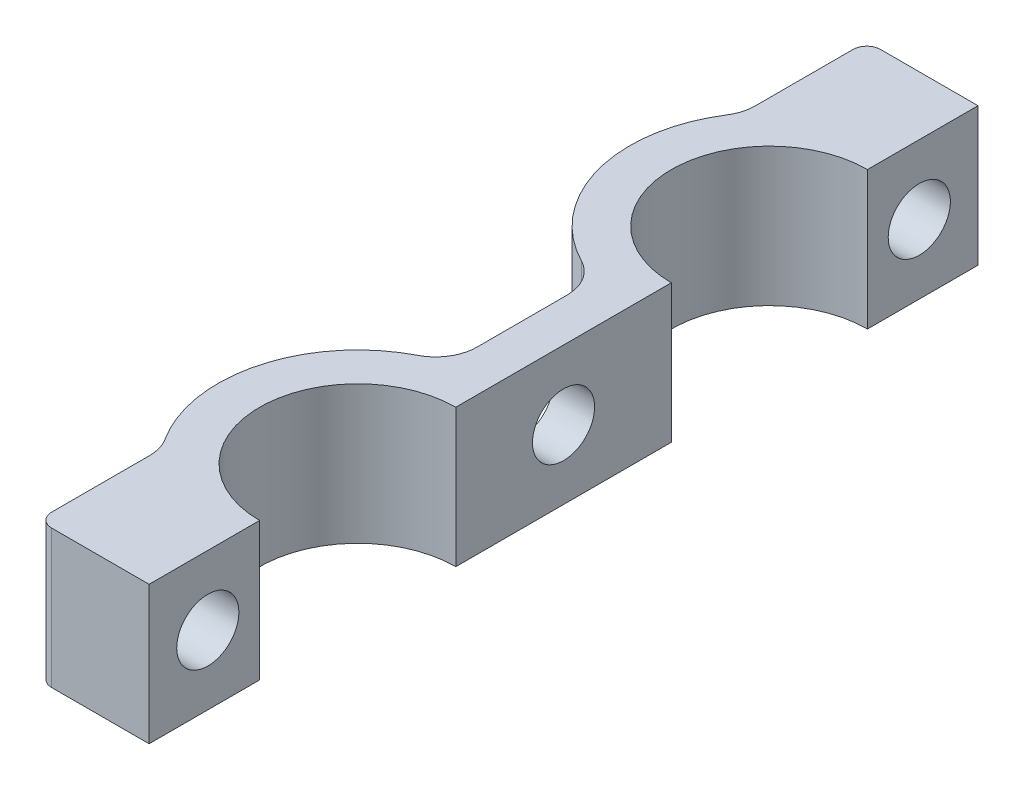
ISO-10303-21;
HEADER;
FILE_DESCRIPTION(('STEP AP214'),'2;1');
FILE_NAME('part.step','',(''),(''),'','','');
FILE_SCHEMA(('AUTOMOTIVE_DESIGN { 1 0 10303 214 1 1 1 1 }'));
ENDSEC;
DATA;
#1=APPLICATION_CONTEXT('core data for automotive mechanical design processes');
#2=APPLICATION_PROTOCOL_DEFINITION('international standard','automotive_design',2000,#1);
#3=PRODUCT_CONTEXT('',#1,'mechanical');
#4=PRODUCT('Part','Part','',(#3));
#5=PRODUCT_RELATED_PRODUCT_CATEGORY('part','',(#4));
#6=PRODUCT_DEFINITION_FORMATION('','',#4);
#7=PRODUCT_DEFINITION_CONTEXT('part definition',#1,'design');
#8=PRODUCT_DEFINITION('design','',#6,#7);
#9=PRODUCT_DEFINITION_SHAPE('','',#8);
#10=(LENGTH_UNIT() NAMED_UNIT(*) SI_UNIT(.MILLI.,.METRE.));
#11=(NAMED_UNIT(*) PLANE_ANGLE_UNIT() SI_UNIT($,.RADIAN.));
#12=(NAMED_UNIT(*) SI_UNIT($,.STERADIAN.) SOLID_ANGLE_UNIT());
#13=UNCERTAINTY_MEASURE_WITH_UNIT(LENGTH_MEASURE(1.E-05),#10,'distance_accuracy_value','');
#14=(GEOMETRIC_REPRESENTATION_CONTEXT(3) GLOBAL_UNCERTAINTY_ASSIGNED_CONTEXT((#13)) GLOBAL_UNIT_ASSIGNED_CONTEXT((#10,
#11,#12)) REPRESENTATION_CONTEXT('',''));
#15=CARTESIAN_POINT('',(0.,0.,0.));
#16=DIRECTION('',(0.,0.,1.));
#17=DIRECTION('',(1.,0.,0.));
#18=AXIS2_PLACEMENT_3D('',#15,#16,#17);
#19=CARTESIAN_POINT('',(-3.,10.,0.));
#20=DIRECTION('',(0.,0.,-1.));
#21=DIRECTION('',(-1.,0.,0.));
#22=AXIS2_PLACEMENT_3D('',#19,#20,#21);
#23=PLANE('',#22);
#24=DIRECTION('',(1.,0.,0.));
#25=VECTOR('',#24,1.);
#26=CARTESIAN_POINT('',(-3.,10.,0.));
#27=LINE('',#26,#25);
#28=CARTESIAN_POINT('',(-7.0498447189993,10.,0.));
#29=VERTEX_POINT('',#28);
#30=CARTESIAN_POINT('',(0.,10.,0.));
#31=VERTEX_POINT('',#30);
#32=EDGE_CURVE('E159',#29,#31,#27,.T.);
#33=ORIENTED_EDGE('',*,*,#32,.F.);
#34=DIRECTION('',(0.,1.,0.));
#35=VECTOR('',#34,1.);
#36=CARTESIAN_POINT('',(-7.0498447189993,0.,0.));
#37=LINE('',#36,#35);
#38=CARTESIAN_POINT('',(-7.0498447189993,0.,0.));
#39=VERTEX_POINT('',#38);
#40=EDGE_CURVE('E231',#29,#39,#37,.F.);
#41=ORIENTED_EDGE('',*,*,#40,.T.);
#42=DIRECTION('',(1.,0.,0.));
#43=VECTOR('',#42,1.);
#44=CARTESIAN_POINT('',(-3.,0.,0.));
#45=LINE('',#44,#43);
#46=CARTESIAN_POINT('',(0.,0.,0.));
#47=VERTEX_POINT('',#46);
#48=EDGE_CURVE('E181',#39,#47,#45,.T.);
#49=ORIENTED_EDGE('',*,*,#48,.T.);
#50=DIRECTION('',(0.,-1.,0.));
#51=VECTOR('',#50,1.);
#52=CARTESIAN_POINT('',(0.,10.,0.));
#53=LINE('',#52,#51);
#54=EDGE_CURVE('E174',#31,#47,#53,.T.);
#55=ORIENTED_EDGE('',*,*,#54,.F.);
#56=EDGE_LOOP('',(#33,#41,#49,#55));
#57=FACE_BOUND('',#56,.T.);
#58=ADVANCED_FACE('F35',(#57),#23,.F.);
#59=CARTESIAN_POINT('',(0.,10.,0.));
#60=DIRECTION('',(-1.,0.,0.));
#61=DIRECTION('',(0.,0.,1.));
#62=AXIS2_PLACEMENT_3D('',#59,#60,#61);
#63=PLANE('',#62);
#64=CARTESIAN_POINT('',(0.,5.,-4.25000000000001));
#65=DIRECTION('',(-1.,0.,0.));
#66=DIRECTION('',(0.,0.,-1.));
#67=AXIS2_PLACEMENT_3D('',#64,#65,#66);
#68=CIRCLE('',#67,2.25);
#69=CARTESIAN_POINT('',(0.,5.,-6.50000000000001));
#70=VERTEX_POINT('',#69);
#71=EDGE_CURVE('E393',#70,#70,#68,.T.);
#72=ORIENTED_EDGE('',*,*,#71,.T.);
#73=EDGE_LOOP('',(#72));
#74=FACE_BOUND('',#73,.T.);
#75=DIRECTION('',(0.,0.,-1.));
#76=VECTOR('',#75,1.);
#77=CARTESIAN_POINT('',(0.,0.,0.));
#78=LINE('',#77,#76);
#79=CARTESIAN_POINT('',(0.,0.,-8.));
#80=VERTEX_POINT('',#79);
#81=EDGE_CURVE('E264',#47,#80,#78,.T.);
#82=ORIENTED_EDGE('',*,*,#81,.T.);
#83=DIRECTION('',(0.,-1.,0.));
#84=VECTOR('',#83,1.);
#85=CARTESIAN_POINT('',(0.,10.,-8.));
#86=LINE('',#85,#84);
#87=CARTESIAN_POINT('',(0.,10.,-8.));
#88=VERTEX_POINT('',#87);
#89=EDGE_CURVE('E176',#88,#80,#86,.T.);
#90=ORIENTED_EDGE('',*,*,#89,.F.);
#91=DIRECTION('',(0.,0.,-1.));
#92=VECTOR('',#91,1.);
#93=CARTESIAN_POINT('',(0.,10.,0.));
#94=LINE('',#93,#92);
#95=EDGE_CURVE('E163',#31,#88,#94,.T.);
#96=ORIENTED_EDGE('',*,*,#95,.F.);
#97=ORIENTED_EDGE('',*,*,#54,.T.);
#98=EDGE_LOOP('',(#82,#90,#96,#97));
#99=FACE_BOUND('',#98,.T.);
#100=ADVANCED_FACE('F173',(#74,#99),#63,.F.);
#101=CARTESIAN_POINT('',(0.,10.,-15.1));
#102=DIRECTION('',(0.,-1.,0.));
#103=DIRECTION('',(0.,0.,-1.));
#104=AXIS2_PLACEMENT_3D('',#101,#102,#103);
#105=CYLINDRICAL_SURFACE('',#104,7.1);
#106=CARTESIAN_POINT('',(0.,0.,-15.1));
#107=DIRECTION('',(0.,-1.,0.));
#108=DIRECTION('',(0.,0.,-1.));
#109=AXIS2_PLACEMENT_3D('',#106,#107,#108);
#110=CIRCLE('',#109,7.1);
#111=CARTESIAN_POINT('',(0.,0.,-22.2));
#112=VERTEX_POINT('',#111);
#113=EDGE_CURVE('E267',#80,#112,#110,.T.);
#114=ORIENTED_EDGE('',*,*,#113,.T.);
#115=DIRECTION('',(0.,-1.,0.));
#116=VECTOR('',#115,1.);
#117=CARTESIAN_POINT('',(0.,10.,-22.2));
#118=LINE('',#117,#116);
#119=CARTESIAN_POINT('',(0.,10.,-22.2));
#120=VERTEX_POINT('',#119);
#121=EDGE_CURVE('E188',#120,#112,#118,.T.);
#122=ORIENTED_EDGE('',*,*,#121,.F.);
#123=CARTESIAN_POINT('',(0.,10.,-15.1));
#124=DIRECTION('',(0.,-1.,0.));
#125=DIRECTION('',(0.,0.,-1.));
#126=AXIS2_PLACEMENT_3D('',#123,#124,#125);
#127=CIRCLE('',#126,7.1);
#128=EDGE_CURVE('E178',#88,#120,#127,.T.);
#129=ORIENTED_EDGE('',*,*,#128,.F.);
#130=ORIENTED_EDGE('',*,*,#89,.T.);
#131=EDGE_LOOP('',(#114,#122,#129,#130));
#132=FACE_BOUND('',#131,.T.);
#133=ADVANCED_FACE('F327',(#132),#105,.F.);
#134=CARTESIAN_POINT('',(0.,10.,-37.8));
#135=DIRECTION('',(-1.,0.,0.));
#136=DIRECTION('',(0.,0.,1.));
#137=AXIS2_PLACEMENT_3D('',#134,#135,#136);
#138=PLANE('',#137);
#139=CARTESIAN_POINT('',(0.,5.,-30.));
#140=DIRECTION('',(-1.,0.,0.));
#141=DIRECTION('',(0.,0.,1.));
#142=AXIS2_PLACEMENT_3D('',#139,#140,#141);
#143=CIRCLE('',#142,2.25);
#144=CARTESIAN_POINT('',(0.,5.,-27.75));
#145=VERTEX_POINT('',#144);
#146=EDGE_CURVE('E387',#145,#145,#143,.T.);
#147=ORIENTED_EDGE('',*,*,#146,.T.);
#148=EDGE_LOOP('',(#147));
#149=FACE_BOUND('',#148,.T.);
#150=DIRECTION('',(0.,0.,-1.));
#151=VECTOR('',#150,1.);
#152=CARTESIAN_POINT('',(0.,0.,-37.8));
#153=LINE('',#152,#151);
#154=CARTESIAN_POINT('',(0.,0.,-37.8));
#155=VERTEX_POINT('',#154);
#156=EDGE_CURVE('E269',#112,#155,#153,.T.);
#157=ORIENTED_EDGE('',*,*,#156,.T.);
#158=DIRECTION('',(0.,-1.,0.));
#159=VECTOR('',#158,1.);
#160=CARTESIAN_POINT('',(0.,10.,-37.8));
#161=LINE('',#160,#159);
#162=CARTESIAN_POINT('',(0.,10.,-37.8));
#163=VERTEX_POINT('',#162);
#164=EDGE_CURVE('E288',#163,#155,#161,.T.);
#165=ORIENTED_EDGE('',*,*,#164,.F.);
#166=DIRECTION('',(0.,0.,-1.));
#167=VECTOR('',#166,1.);
#168=CARTESIAN_POINT('',(0.,10.,-37.8));
#169=LINE('',#168,#167);
#170=EDGE_CURVE('E297',#120,#163,#169,.T.);
#171=ORIENTED_EDGE('',*,*,#170,.F.);
#172=ORIENTED_EDGE('',*,*,#121,.T.);
#173=EDGE_LOOP('',(#157,#165,#171,#172));
#174=FACE_BOUND('',#173,.T.);
#175=ADVANCED_FACE('F295',(#149,#174),#138,.F.);
#176=CARTESIAN_POINT('',(0.,10.,-44.9));
#177=DIRECTION('',(0.,-1.,0.));
#178=DIRECTION('',(0.,0.,-1.));
#179=AXIS2_PLACEMENT_3D('',#176,#177,#178);
#180=CYLINDRICAL_SURFACE('',#179,7.1);
#181=CARTESIAN_POINT('',(0.,0.,-44.9));
#182=DIRECTION('',(0.,-1.,0.));
#183=DIRECTION('',(0.,0.,1.));
#184=AXIS2_PLACEMENT_3D('',#181,#182,#183);
#185=CIRCLE('',#184,7.1);
#186=CARTESIAN_POINT('',(0.,0.,-52.));
#187=VERTEX_POINT('',#186);
#188=EDGE_CURVE('E271',#155,#187,#185,.T.);
#189=ORIENTED_EDGE('',*,*,#188,.T.);
#190=DIRECTION('',(0.,-1.,0.));
#191=VECTOR('',#190,1.);
#192=CARTESIAN_POINT('',(0.,10.,-52.));
#193=LINE('',#192,#191);
#194=CARTESIAN_POINT('',(0.,10.,-52.));
#195=VERTEX_POINT('',#194);
#196=EDGE_CURVE('E285',#195,#187,#193,.T.);
#197=ORIENTED_EDGE('',*,*,#196,.F.);
#198=CARTESIAN_POINT('',(0.,10.,-44.9));
#199=DIRECTION('',(0.,-1.,0.));
#200=DIRECTION('',(0.,0.,1.));
#201=AXIS2_PLACEMENT_3D('',#198,#199,#200);
#202=CIRCLE('',#201,7.1);
#203=EDGE_CURVE('E253',#163,#195,#202,.T.);
#204=ORIENTED_EDGE('',*,*,#203,.F.);
#205=ORIENTED_EDGE('',*,*,#164,.T.);
#206=EDGE_LOOP('',(#189,#197,#204,#205));
#207=FACE_BOUND('',#206,.T.);
#208=ADVANCED_FACE('F305',(#207),#180,.F.);
#209=CARTESIAN_POINT('',(0.,10.,-60.));
#210=DIRECTION('',(-1.,0.,0.));
#211=DIRECTION('',(0.,0.,1.));
#212=AXIS2_PLACEMENT_3D('',#209,#210,#211);
#213=PLANE('',#212);
#214=CARTESIAN_POINT('',(0.,5.,-55.75));
#215=DIRECTION('',(-1.,0.,0.));
#216=DIRECTION('',(0.,0.,1.));
#217=AXIS2_PLACEMENT_3D('',#214,#215,#216);
#218=CIRCLE('',#217,2.25);
#219=CARTESIAN_POINT('',(0.,5.,-53.5));
#220=VERTEX_POINT('',#219);
#221=EDGE_CURVE('E368',#220,#220,#218,.T.);
#222=ORIENTED_EDGE('',*,*,#221,.T.);
#223=EDGE_LOOP('',(#222));
#224=FACE_BOUND('',#223,.T.);
#225=DIRECTION('',(0.,0.,-1.));
#226=VECTOR('',#225,1.);
#227=CARTESIAN_POINT('',(0.,0.,-60.));
#228=LINE('',#227,#226);
#229=CARTESIAN_POINT('',(0.,0.,-60.));
#230=VERTEX_POINT('',#229);
#231=EDGE_CURVE('E273',#187,#230,#228,.T.);
#232=ORIENTED_EDGE('',*,*,#231,.T.);
#233=DIRECTION('',(0.,-1.,0.));
#234=VECTOR('',#233,1.);
#235=CARTESIAN_POINT('',(0.,10.,-60.));
#236=LINE('',#235,#234);
#237=CARTESIAN_POINT('',(0.,10.,-60.));
#238=VERTEX_POINT('',#237);
#239=EDGE_CURVE('E262',#238,#230,#236,.T.);
#240=ORIENTED_EDGE('',*,*,#239,.F.);
#241=DIRECTION('',(0.,0.,-1.));
#242=VECTOR('',#241,1.);
#243=CARTESIAN_POINT('',(0.,10.,-60.));
#244=LINE('',#243,#242);
#245=EDGE_CURVE('E246',#195,#238,#244,.T.);
#246=ORIENTED_EDGE('',*,*,#245,.F.);
#247=ORIENTED_EDGE('',*,*,#196,.T.);
#248=EDGE_LOOP('',(#232,#240,#246,#247));
#249=FACE_BOUND('',#248,.T.);
#250=ADVANCED_FACE('F308',(#224,#249),#213,.F.);
#251=CARTESIAN_POINT('',(-3.,10.,-60.));
#252=DIRECTION('',(0.,0.,1.));
#253=DIRECTION('',(1.,0.,0.));
#254=AXIS2_PLACEMENT_3D('',#251,#252,#253);
#255=PLANE('',#254);
#256=DIRECTION('',(-1.,0.,0.));
#257=VECTOR('',#256,1.);
#258=CARTESIAN_POINT('',(-3.,0.,-60.));
#259=LINE('',#258,#257);
#260=CARTESIAN_POINT('',(-7.04984471899923,0.,-60.));
#261=VERTEX_POINT('',#260);
#262=EDGE_CURVE('E243',#230,#261,#259,.T.);
#263=ORIENTED_EDGE('',*,*,#262,.T.);
#264=DIRECTION('',(0.,1.,0.));
#265=VECTOR('',#264,1.);
#266=CARTESIAN_POINT('',(-7.04984471899923,10.,-60.));
#267=LINE('',#266,#265);
#268=CARTESIAN_POINT('',(-7.04984471899923,10.,-60.));
#269=VERTEX_POINT('',#268);
#270=EDGE_CURVE('E43',#261,#269,#267,.T.);
#271=ORIENTED_EDGE('',*,*,#270,.T.);
#272=DIRECTION('',(-1.,0.,0.));
#273=VECTOR('',#272,1.);
#274=CARTESIAN_POINT('',(-3.,10.,-60.));
#275=LINE('',#274,#273);
#276=EDGE_CURVE('E242',#238,#269,#275,.T.);
#277=ORIENTED_EDGE('',*,*,#276,.F.);
#278=ORIENTED_EDGE('',*,*,#239,.T.);
#279=EDGE_LOOP('',(#263,#271,#277,#278));
#280=FACE_BOUND('',#279,.T.);
#281=ADVANCED_FACE('F240',(#280),#255,.F.);
#282=CARTESIAN_POINT('',(0.,10.,-44.9));
#283=DIRECTION('',(0.,-1.,0.));
#284=DIRECTION('',(0.,0.,-1.));
#285=AXIS2_PLACEMENT_3D('',#282,#283,#284);
#286=CYLINDRICAL_SURFACE('',#285,10.1);
#287=CARTESIAN_POINT('',(0.,10.,-44.9));
#288=DIRECTION('',(0.,1.,0.));
#289=DIRECTION('',(0.,0.,1.));
#290=AXIS2_PLACEMENT_3D('',#287,#288,#289);
#291=CIRCLE('',#290,10.1);
#292=CARTESIAN_POINT('',(-8.51934592838871,10.,-50.3250110555137));
#293=VERTEX_POINT('',#292);
#294=CARTESIAN_POINT('',(-4.62595419847328,10.,-35.9216623056588));
#295=VERTEX_POINT('',#294);
#296=EDGE_CURVE('E248',#293,#295,#291,.T.);
#297=ORIENTED_EDGE('',*,*,#296,.F.);
#298=DIRECTION('',(0.,-1.,0.));
#299=VECTOR('',#298,1.);
#300=CARTESIAN_POINT('',(-8.51934592838872,10.,-50.3250110555137));
#301=LINE('',#300,#299);
#302=CARTESIAN_POINT('',(-8.51934592838871,0.,-50.3250110555137));
#303=VERTEX_POINT('',#302);
#304=EDGE_CURVE('E201',#293,#303,#301,.T.);
#305=ORIENTED_EDGE('',*,*,#304,.T.);
#306=CARTESIAN_POINT('',(0.,0.,-44.9));
#307=DIRECTION('',(0.,1.,0.));
#308=DIRECTION('',(0.,0.,1.));
#309=AXIS2_PLACEMENT_3D('',#306,#307,#308);
#310=CIRCLE('',#309,10.1);
#311=CARTESIAN_POINT('',(-4.62595419847328,0.,-35.9216623056588));
#312=VERTEX_POINT('',#311);
#313=EDGE_CURVE('E276',#303,#312,#310,.T.);
#314=ORIENTED_EDGE('',*,*,#313,.T.);
#315=DIRECTION('',(0.,-1.,0.));
#316=VECTOR('',#315,1.);
#317=CARTESIAN_POINT('',(-4.62595419847328,10.,-35.9216623056588));
#318=LINE('',#317,#316);
#319=EDGE_CURVE('E199',#312,#295,#318,.F.);
#320=ORIENTED_EDGE('',*,*,#319,.T.);
#321=EDGE_LOOP('',(#297,#305,#314,#320));
#322=FACE_BOUND('',#321,.T.);
#323=ADVANCED_FACE('F317',(#322),#286,.T.);
#324=CARTESIAN_POINT('',(-3.,10.,-35.2558307770965));
#325=DIRECTION('',(1.,0.,0.));
#326=DIRECTION('',(0.,0.,-1.));
#327=AXIS2_PLACEMENT_3D('',#324,#325,#326);
#328=PLANE('',#327);
#329=CARTESIAN_POINT('',(-3.,5.,-30.));
#330=DIRECTION('',(-1.,0.,0.));
#331=DIRECTION('',(0.,0.,1.));
#332=AXIS2_PLACEMENT_3D('',#329,#330,#331);
#333=CIRCLE('',#332,2.25);
#334=CARTESIAN_POINT('',(-3.,5.,-27.75));
#335=VERTEX_POINT('',#334);
#336=EDGE_CURVE('E390',#335,#335,#333,.T.);
#337=ORIENTED_EDGE('',*,*,#336,.F.);
#338=EDGE_LOOP('',(#337));
#339=FACE_BOUND('',#338,.T.);
#340=DIRECTION('',(0.,0.,1.));
#341=VECTOR('',#340,1.);
#342=CARTESIAN_POINT('',(-3.,10.,-35.2558307770965));
#343=LINE('',#342,#341);
#344=CARTESIAN_POINT('',(-3.,10.,-33.2548293271417));
#345=VERTEX_POINT('',#344);
#346=CARTESIAN_POINT('',(-3.,10.,-26.7451706728583));
#347=VERTEX_POINT('',#346);
#348=EDGE_CURVE('E251',#345,#347,#343,.T.);
#349=ORIENTED_EDGE('',*,*,#348,.F.);
#350=DIRECTION('',(0.,1.,0.));
#351=VECTOR('',#350,1.);
#352=CARTESIAN_POINT('',(-3.,0.,-33.2548293271417));
#353=LINE('',#352,#351);
#354=CARTESIAN_POINT('',(-3.,0.,-33.2548293271417));
#355=VERTEX_POINT('',#354);
#356=EDGE_CURVE('E205',#345,#355,#353,.F.);
#357=ORIENTED_EDGE('',*,*,#356,.T.);
#358=DIRECTION('',(0.,0.,1.));
#359=VECTOR('',#358,1.);
#360=CARTESIAN_POINT('',(-3.,0.,-35.2558307770965));
#361=LINE('',#360,#359);
#362=CARTESIAN_POINT('',(-3.,0.,-26.7451706728583));
#363=VERTEX_POINT('',#362);
#364=EDGE_CURVE('E279',#355,#363,#361,.T.);
#365=ORIENTED_EDGE('',*,*,#364,.T.);
#366=DIRECTION('',(0.,1.,0.));
#367=VECTOR('',#366,1.);
#368=CARTESIAN_POINT('',(-3.,10.,-26.7451706728583));
#369=LINE('',#368,#367);
#370=EDGE_CURVE('E203',#363,#347,#369,.T.);
#371=ORIENTED_EDGE('',*,*,#370,.T.);
#372=EDGE_LOOP('',(#349,#357,#365,#371));
#373=FACE_BOUND('',#372,.T.);
#374=ADVANCED_FACE('F427',(#339,#373),#328,.F.);
#375=CARTESIAN_POINT('',(0.,10.,-15.1));
#376=DIRECTION('',(0.,-1.,0.));
#377=DIRECTION('',(0.,0.,-1.));
#378=AXIS2_PLACEMENT_3D('',#375,#376,#377);
#379=CYLINDRICAL_SURFACE('',#378,10.1);
#380=CARTESIAN_POINT('',(0.,0.,-15.1));
#381=DIRECTION('',(0.,1.,0.));
#382=DIRECTION('',(0.,0.,-1.));
#383=AXIS2_PLACEMENT_3D('',#380,#381,#382);
#384=CIRCLE('',#383,10.1);
#385=CARTESIAN_POINT('',(-4.62595419847328,0.,-24.0783376943412));
#386=VERTEX_POINT('',#385);
#387=CARTESIAN_POINT('',(-8.51934592838876,0.,-9.6749889444863));
#388=VERTEX_POINT('',#387);
#389=EDGE_CURVE('E169',#386,#388,#384,.T.);
#390=ORIENTED_EDGE('',*,*,#389,.T.);
#391=DIRECTION('',(0.,-1.,0.));
#392=VECTOR('',#391,1.);
#393=CARTESIAN_POINT('',(-8.51934592838876,10.,-9.6749889444863));
#394=LINE('',#393,#392);
#395=CARTESIAN_POINT('',(-8.51934592838876,10.,-9.6749889444863));
#396=VERTEX_POINT('',#395);
#397=EDGE_CURVE('E186',#388,#396,#394,.F.);
#398=ORIENTED_EDGE('',*,*,#397,.T.);
#399=CARTESIAN_POINT('',(0.,10.,-15.1));
#400=DIRECTION('',(0.,1.,0.));
#401=DIRECTION('',(0.,0.,-1.));
#402=AXIS2_PLACEMENT_3D('',#399,#400,#401);
#403=CIRCLE('',#402,10.1);
#404=CARTESIAN_POINT('',(-4.62595419847328,10.,-24.0783376943412));
#405=VERTEX_POINT('',#404);
#406=EDGE_CURVE('E259',#405,#396,#403,.T.);
#407=ORIENTED_EDGE('',*,*,#406,.F.);
#408=DIRECTION('',(0.,-1.,0.));
#409=VECTOR('',#408,1.);
#410=CARTESIAN_POINT('',(-4.62595419847328,10.,-24.0783376943412));
#411=LINE('',#410,#409);
#412=EDGE_CURVE('E183',#405,#386,#411,.T.);
#413=ORIENTED_EDGE('',*,*,#412,.T.);
#414=EDGE_LOOP('',(#390,#398,#407,#413));
#415=FACE_BOUND('',#414,.T.);
#416=ADVANCED_FACE('F434',(#415),#379,.T.);
#417=CARTESIAN_POINT('',(0.,10.,-15.1));
#418=DIRECTION('',(0.,-1.,0.));
#419=DIRECTION('',(0.,0.,-1.));
#420=AXIS2_PLACEMENT_3D('',#417,#418,#419);
#421=PLANE('',#420);
#422=DIRECTION('',(0.,0.,1.));
#423=VECTOR('',#422,1.);
#424=CARTESIAN_POINT('',(-8.0498447189993,10.,0.));
#425=LINE('',#424,#423);
#426=CARTESIAN_POINT('',(-8.04984471899928,10.,-8.06359952205648));
#427=VERTEX_POINT('',#426);
#428=CARTESIAN_POINT('',(-8.0498447189993,10.,-1.));
#429=VERTEX_POINT('',#428);
#430=EDGE_CURVE('E365',#427,#429,#425,.T.);
#431=ORIENTED_EDGE('',*,*,#430,.T.);
#432=CARTESIAN_POINT('',(-7.0498447189993,10.,-1.));
#433=DIRECTION('',(0.,-1.,0.));
#434=DIRECTION('',(0.,0.,-1.));
#435=AXIS2_PLACEMENT_3D('',#432,#433,#434);
#436=CIRCLE('',#435,1.);
#437=EDGE_CURVE('E165',#429,#29,#436,.F.);
#438=ORIENTED_EDGE('',*,*,#437,.T.);
#439=ORIENTED_EDGE('',*,*,#32,.T.);
#440=ORIENTED_EDGE('',*,*,#95,.T.);
#441=ORIENTED_EDGE('',*,*,#128,.T.);
#442=ORIENTED_EDGE('',*,*,#170,.T.);
#443=ORIENTED_EDGE('',*,*,#203,.T.);
#444=ORIENTED_EDGE('',*,*,#245,.T.);
#445=ORIENTED_EDGE('',*,*,#276,.T.);
#446=CARTESIAN_POINT('',(-7.04984471899923,10.,-59.));
#447=DIRECTION('',(0.,-1.,0.));
#448=DIRECTION('',(0.,0.,-1.));
#449=AXIS2_PLACEMENT_3D('',#446,#447,#448);
#450=CIRCLE('',#449,1.);
#451=CARTESIAN_POINT('',(-8.04984471899923,10.,-59.));
#452=VERTEX_POINT('',#451);
#453=EDGE_CURVE('E228',#269,#452,#450,.F.);
#454=ORIENTED_EDGE('',*,*,#453,.T.);
#455=DIRECTION('',(0.,0.,1.));
#456=VECTOR('',#455,1.);
#457=CARTESIAN_POINT('',(-8.04984471899923,10.,-60.));
#458=LINE('',#457,#456);
#459=CARTESIAN_POINT('',(-8.04984471899923,10.,-51.9364004779436));
#460=VERTEX_POINT('',#459);
#461=EDGE_CURVE('E364',#452,#460,#458,.T.);
#462=ORIENTED_EDGE('',*,*,#461,.T.);
#463=CARTESIAN_POINT('',(-11.0498447189992,10.,-51.9364004779436));
#464=DIRECTION('',(0.,-1.,0.));
#465=DIRECTION('',(0.,0.,-1.));
#466=AXIS2_PLACEMENT_3D('',#463,#464,#465);
#467=CIRCLE('',#466,3.);
#468=EDGE_CURVE('E212',#460,#293,#467,.T.);
#469=ORIENTED_EDGE('',*,*,#468,.T.);
#470=ORIENTED_EDGE('',*,*,#296,.T.);
#471=CARTESIAN_POINT('',(-6.,10.,-33.2548293271417));
#472=DIRECTION('',(0.,-1.,0.));
#473=DIRECTION('',(0.,0.,-1.));
#474=AXIS2_PLACEMENT_3D('',#471,#472,#473);
#475=CIRCLE('',#474,3.);
#476=EDGE_CURVE('E219',#295,#345,#475,.T.);
#477=ORIENTED_EDGE('',*,*,#476,.T.);
#478=ORIENTED_EDGE('',*,*,#348,.T.);
#479=CARTESIAN_POINT('',(-6.,10.,-26.7451706728583));
#480=DIRECTION('',(0.,-1.,0.));
#481=DIRECTION('',(0.,0.,-1.));
#482=AXIS2_PLACEMENT_3D('',#479,#480,#481);
#483=CIRCLE('',#482,3.);
#484=EDGE_CURVE('E223',#347,#405,#483,.T.);
#485=ORIENTED_EDGE('',*,*,#484,.T.);
#486=ORIENTED_EDGE('',*,*,#406,.T.);
#487=CARTESIAN_POINT('',(-11.0498447189993,10.,-8.06359952205648));
#488=DIRECTION('',(0.,-1.,0.));
#489=DIRECTION('',(0.,0.,-1.));
#490=AXIS2_PLACEMENT_3D('',#487,#488,#489);
#491=CIRCLE('',#490,3.);
#492=EDGE_CURVE('E208',#396,#427,#491,.T.);
#493=ORIENTED_EDGE('',*,*,#492,.T.);
#494=EDGE_LOOP('',(#431,#438,#439,#440,#441,#442,#443,#444,#445,#454,#462,#469,#470,#477,#478,
#485,#486,#493));
#495=FACE_BOUND('',#494,.T.);
#496=ADVANCED_FACE('F162',(#495),#421,.F.);
#497=CARTESIAN_POINT('',(0.,0.,-15.1));
#498=DIRECTION('',(0.,-1.,0.));
#499=DIRECTION('',(0.,0.,-1.));
#500=AXIS2_PLACEMENT_3D('',#497,#498,#499);
#501=PLANE('',#500);
#502=ORIENTED_EDGE('',*,*,#48,.F.);
#503=CARTESIAN_POINT('',(-7.0498447189993,0.,-1.));
#504=DIRECTION('',(0.,-1.,0.));
#505=DIRECTION('',(0.,0.,-1.));
#506=AXIS2_PLACEMENT_3D('',#503,#504,#505);
#507=CIRCLE('',#506,1.);
#508=CARTESIAN_POINT('',(-8.0498447189993,0.,-1.));
#509=VERTEX_POINT('',#508);
#510=EDGE_CURVE('E234',#39,#509,#507,.T.);
#511=ORIENTED_EDGE('',*,*,#510,.T.);
#512=DIRECTION('',(0.,0.,1.));
#513=VECTOR('',#512,1.);
#514=CARTESIAN_POINT('',(-8.0498447189993,0.,0.));
#515=LINE('',#514,#513);
#516=CARTESIAN_POINT('',(-8.04984471899928,0.,-8.06359952205648));
#517=VERTEX_POINT('',#516);
#518=EDGE_CURVE('E358',#517,#509,#515,.T.);
#519=ORIENTED_EDGE('',*,*,#518,.F.);
#520=CARTESIAN_POINT('',(-11.0498447189993,0.,-8.06359952205648));
#521=DIRECTION('',(0.,-1.,0.));
#522=DIRECTION('',(0.,0.,-1.));
#523=AXIS2_PLACEMENT_3D('',#520,#521,#522);
#524=CIRCLE('',#523,3.);
#525=EDGE_CURVE('E210',#517,#388,#524,.F.);
#526=ORIENTED_EDGE('',*,*,#525,.T.);
#527=ORIENTED_EDGE('',*,*,#389,.F.);
#528=CARTESIAN_POINT('',(-6.,0.,-26.7451706728583));
#529=DIRECTION('',(0.,-1.,0.));
#530=DIRECTION('',(0.,0.,-1.));
#531=AXIS2_PLACEMENT_3D('',#528,#529,#530);
#532=CIRCLE('',#531,3.);
#533=EDGE_CURVE('E221',#386,#363,#532,.F.);
#534=ORIENTED_EDGE('',*,*,#533,.T.);
#535=ORIENTED_EDGE('',*,*,#364,.F.);
#536=CARTESIAN_POINT('',(-6.,0.,-33.2548293271417));
#537=DIRECTION('',(0.,-1.,0.));
#538=DIRECTION('',(0.,0.,-1.));
#539=AXIS2_PLACEMENT_3D('',#536,#537,#538);
#540=CIRCLE('',#539,3.);
#541=EDGE_CURVE('E217',#355,#312,#540,.F.);
#542=ORIENTED_EDGE('',*,*,#541,.T.);
#543=ORIENTED_EDGE('',*,*,#313,.F.);
#544=CARTESIAN_POINT('',(-11.0498447189992,0.,-51.9364004779436));
#545=DIRECTION('',(0.,-1.,0.));
#546=DIRECTION('',(0.,0.,-1.));
#547=AXIS2_PLACEMENT_3D('',#544,#545,#546);
#548=CIRCLE('',#547,3.);
#549=CARTESIAN_POINT('',(-8.04984471899923,0.,-51.9364004779436));
#550=VERTEX_POINT('',#549);
#551=EDGE_CURVE('E214',#303,#550,#548,.F.);
#552=ORIENTED_EDGE('',*,*,#551,.T.);
#553=DIRECTION('',(0.,0.,1.));
#554=VECTOR('',#553,1.);
#555=CARTESIAN_POINT('',(-8.04984471899923,0.,-60.));
#556=LINE('',#555,#554);
#557=CARTESIAN_POINT('',(-8.04984471899923,0.,-59.));
#558=VERTEX_POINT('',#557);
#559=EDGE_CURVE('E265',#558,#550,#556,.T.);
#560=ORIENTED_EDGE('',*,*,#559,.F.);
#561=CARTESIAN_POINT('',(-7.04984471899923,0.,-59.));
#562=DIRECTION('',(0.,-1.,0.));
#563=DIRECTION('',(0.,0.,-1.));
#564=AXIS2_PLACEMENT_3D('',#561,#562,#563);
#565=CIRCLE('',#564,1.);
#566=EDGE_CURVE('E50',#558,#261,#565,.T.);
#567=ORIENTED_EDGE('',*,*,#566,.T.);
#568=ORIENTED_EDGE('',*,*,#262,.F.);
#569=ORIENTED_EDGE('',*,*,#231,.F.);
#570=ORIENTED_EDGE('',*,*,#188,.F.);
#571=ORIENTED_EDGE('',*,*,#156,.F.);
#572=ORIENTED_EDGE('',*,*,#113,.F.);
#573=ORIENTED_EDGE('',*,*,#81,.F.);
#574=EDGE_LOOP('',(#502,#511,#519,#526,#527,#534,#535,#542,#543,#552,#560,#567,#568,#569,#570,
#571,#572,#573));
#575=FACE_BOUND('',#574,.T.);
#576=ADVANCED_FACE('F301',(#575),#501,.T.);
#577=CARTESIAN_POINT('',(-8.04984471899923,-10.3199288605109,-60.));
#578=DIRECTION('',(-1.,0.,0.));
#579=DIRECTION('',(0.,0.,1.));
#580=AXIS2_PLACEMENT_3D('',#577,#578,#579);
#581=PLANE('',#580);
#582=CARTESIAN_POINT('',(-8.04984471899923,5.,-55.75));
#583=DIRECTION('',(-1.,0.,0.));
#584=DIRECTION('',(0.,0.,1.));
#585=AXIS2_PLACEMENT_3D('',#582,#583,#584);
#586=CIRCLE('',#585,2.25);
#587=CARTESIAN_POINT('',(-8.04984471899923,5.,-53.5));
#588=VERTEX_POINT('',#587);
#589=EDGE_CURVE('E400',#588,#588,#586,.T.);
#590=ORIENTED_EDGE('',*,*,#589,.F.);
#591=EDGE_LOOP('',(#590));
#592=FACE_BOUND('',#591,.T.);
#593=ORIENTED_EDGE('',*,*,#461,.F.);
#594=DIRECTION('',(0.,1.,0.));
#595=VECTOR('',#594,1.);
#596=CARTESIAN_POINT('',(-8.04984471899923,0.,-59.));
#597=LINE('',#596,#595);
#598=EDGE_CURVE('E11',#452,#558,#597,.F.);
#599=ORIENTED_EDGE('',*,*,#598,.T.);
#600=ORIENTED_EDGE('',*,*,#559,.T.);
#601=DIRECTION('',(0.,-1.,0.));
#602=VECTOR('',#601,1.);
#603=CARTESIAN_POINT('',(-8.04984471899923,-10.3199288605109,-51.9364004779436));
#604=LINE('',#603,#602);
#605=EDGE_CURVE('E196',#550,#460,#604,.F.);
#606=ORIENTED_EDGE('',*,*,#605,.T.);
#607=EDGE_LOOP('',(#593,#599,#600,#606));
#608=FACE_BOUND('',#607,.T.);
#609=ADVANCED_FACE('F411',(#592,#608),#581,.T.);
#610=CARTESIAN_POINT('',(-8.0498447189993,-10.3199288605109,0.));
#611=DIRECTION('',(-1.,0.,0.));
#612=DIRECTION('',(0.,0.,1.));
#613=AXIS2_PLACEMENT_3D('',#610,#611,#612);
#614=PLANE('',#613);
#615=CARTESIAN_POINT('',(-8.04984471899922,5.,-4.25000000000001));
#616=DIRECTION('',(-1.,0.,0.));
#617=DIRECTION('',(0.,0.,1.));
#618=AXIS2_PLACEMENT_3D('',#615,#616,#617);
#619=CIRCLE('',#618,2.25);
#620=CARTESIAN_POINT('',(-8.04984471899922,5.,-2.00000000000001));
#621=VERTEX_POINT('',#620);
#622=EDGE_CURVE('E389',#621,#621,#619,.T.);
#623=ORIENTED_EDGE('',*,*,#622,.F.);
#624=EDGE_LOOP('',(#623));
#625=FACE_BOUND('',#624,.T.);
#626=ORIENTED_EDGE('',*,*,#518,.T.);
#627=DIRECTION('',(0.,1.,0.));
#628=VECTOR('',#627,1.);
#629=CARTESIAN_POINT('',(-8.0498447189993,10.,-1.));
#630=LINE('',#629,#628);
#631=EDGE_CURVE('E225',#509,#429,#630,.T.);
#632=ORIENTED_EDGE('',*,*,#631,.T.);
#633=ORIENTED_EDGE('',*,*,#430,.F.);
#634=DIRECTION('',(0.,-1.,0.));
#635=VECTOR('',#634,1.);
#636=CARTESIAN_POINT('',(-8.04984471899928,-10.3199288605109,-8.06359952205648));
#637=LINE('',#636,#635);
#638=EDGE_CURVE('E194',#427,#517,#637,.T.);
#639=ORIENTED_EDGE('',*,*,#638,.T.);
#640=EDGE_LOOP('',(#626,#632,#633,#639));
#641=FACE_BOUND('',#640,.T.);
#642=ADVANCED_FACE('F361',(#625,#641),#614,.T.);
#643=CARTESIAN_POINT('',(0.,5.,-55.75));
#644=DIRECTION('',(-1.,0.,0.));
#645=DIRECTION('',(0.,0.,1.));
#646=AXIS2_PLACEMENT_3D('',#643,#644,#645);
#647=CYLINDRICAL_SURFACE('',#646,2.25);
#648=ORIENTED_EDGE('',*,*,#221,.F.);
#649=EDGE_LOOP('',(#648));
#650=FACE_BOUND('',#649,.T.);
#651=ORIENTED_EDGE('',*,*,#589,.T.);
#652=EDGE_LOOP('',(#651));
#653=FACE_BOUND('',#652,.T.);
#654=ADVANCED_FACE('F404',(#650,#653),#647,.F.);
#655=CARTESIAN_POINT('',(0.,5.,-4.25000000000001));
#656=DIRECTION('',(-1.,0.,0.));
#657=DIRECTION('',(0.,0.,1.));
#658=AXIS2_PLACEMENT_3D('',#655,#656,#657);
#659=CYLINDRICAL_SURFACE('',#658,2.25);
#660=ORIENTED_EDGE('',*,*,#71,.F.);
#661=EDGE_LOOP('',(#660));
#662=FACE_BOUND('',#661,.T.);
#663=ORIENTED_EDGE('',*,*,#622,.T.);
#664=EDGE_LOOP('',(#663));
#665=FACE_BOUND('',#664,.T.);
#666=ADVANCED_FACE('F407',(#662,#665),#659,.F.);
#667=CARTESIAN_POINT('',(0.,5.,-30.));
#668=DIRECTION('',(-1.,0.,0.));
#669=DIRECTION('',(0.,0.,1.));
#670=AXIS2_PLACEMENT_3D('',#667,#668,#669);
#671=CYLINDRICAL_SURFACE('',#670,2.25);
#672=ORIENTED_EDGE('',*,*,#146,.F.);
#673=EDGE_LOOP('',(#672));
#674=FACE_BOUND('',#673,.T.);
#675=ORIENTED_EDGE('',*,*,#336,.T.);
#676=EDGE_LOOP('',(#675));
#677=FACE_BOUND('',#676,.T.);
#678=ADVANCED_FACE('F336',(#674,#677),#671,.F.);
#679=CARTESIAN_POINT('',(-11.0498447189993,10.,-8.06359952205648));
#680=DIRECTION('',(0.,-1.,0.));
#681=DIRECTION('',(0.,0.,-1.));
#682=AXIS2_PLACEMENT_3D('',#679,#680,#681);
#683=CYLINDRICAL_SURFACE('',#682,3.);
#684=ORIENTED_EDGE('',*,*,#525,.F.);
#685=ORIENTED_EDGE('',*,*,#638,.F.);
#686=ORIENTED_EDGE('',*,*,#492,.F.);
#687=ORIENTED_EDGE('',*,*,#397,.F.);
#688=EDGE_LOOP('',(#684,#685,#686,#687));
#689=FACE_BOUND('',#688,.T.);
#690=ADVANCED_FACE('F332',(#689),#683,.F.);
#691=CARTESIAN_POINT('',(-11.0498447189992,10.,-51.9364004779436));
#692=DIRECTION('',(0.,-1.,0.));
#693=DIRECTION('',(0.,0.,-1.));
#694=AXIS2_PLACEMENT_3D('',#691,#692,#693);
#695=CYLINDRICAL_SURFACE('',#694,3.);
#696=ORIENTED_EDGE('',*,*,#551,.F.);
#697=ORIENTED_EDGE('',*,*,#304,.F.);
#698=ORIENTED_EDGE('',*,*,#468,.F.);
#699=ORIENTED_EDGE('',*,*,#605,.F.);
#700=EDGE_LOOP('',(#696,#697,#698,#699));
#701=FACE_BOUND('',#700,.T.);
#702=ADVANCED_FACE('F335',(#701),#695,.F.);
#703=CARTESIAN_POINT('',(-6.,10.,-33.2548293271417));
#704=DIRECTION('',(0.,-1.,0.));
#705=DIRECTION('',(0.,0.,-1.));
#706=AXIS2_PLACEMENT_3D('',#703,#704,#705);
#707=CYLINDRICAL_SURFACE('',#706,3.);
#708=ORIENTED_EDGE('',*,*,#476,.F.);
#709=ORIENTED_EDGE('',*,*,#319,.F.);
#710=ORIENTED_EDGE('',*,*,#541,.F.);
#711=ORIENTED_EDGE('',*,*,#356,.F.);
#712=EDGE_LOOP('',(#708,#709,#710,#711));
#713=FACE_BOUND('',#712,.T.);
#714=ADVANCED_FACE('F340',(#713),#707,.F.);
#715=CARTESIAN_POINT('',(-6.,10.,-26.7451706728583));
#716=DIRECTION('',(0.,-1.,0.));
#717=DIRECTION('',(0.,0.,-1.));
#718=AXIS2_PLACEMENT_3D('',#715,#716,#717);
#719=CYLINDRICAL_SURFACE('',#718,3.);
#720=ORIENTED_EDGE('',*,*,#484,.F.);
#721=ORIENTED_EDGE('',*,*,#370,.F.);
#722=ORIENTED_EDGE('',*,*,#533,.F.);
#723=ORIENTED_EDGE('',*,*,#412,.F.);
#724=EDGE_LOOP('',(#720,#721,#722,#723));
#725=FACE_BOUND('',#724,.T.);
#726=ADVANCED_FACE('F344',(#725),#719,.F.);
#727=CARTESIAN_POINT('',(-7.0498447189993,-10.3199288605109,-1.));
#728=DIRECTION('',(0.,-1.,0.));
#729=DIRECTION('',(0.,0.,-1.));
#730=AXIS2_PLACEMENT_3D('',#727,#728,#729);
#731=CYLINDRICAL_SURFACE('',#730,1.);
#732=ORIENTED_EDGE('',*,*,#510,.F.);
#733=ORIENTED_EDGE('',*,*,#40,.F.);
#734=ORIENTED_EDGE('',*,*,#437,.F.);
#735=ORIENTED_EDGE('',*,*,#631,.F.);
#736=EDGE_LOOP('',(#732,#733,#734,#735));
#737=FACE_BOUND('',#736,.T.);
#738=ADVANCED_FACE('F347',(#737),#731,.T.);
#739=CARTESIAN_POINT('',(-7.04984471899923,10.,-59.));
#740=DIRECTION('',(0.,-1.,0.));
#741=DIRECTION('',(0.,0.,-1.));
#742=AXIS2_PLACEMENT_3D('',#739,#740,#741);
#743=CYLINDRICAL_SURFACE('',#742,1.);
#744=ORIENTED_EDGE('',*,*,#566,.F.);
#745=ORIENTED_EDGE('',*,*,#598,.F.);
#746=ORIENTED_EDGE('',*,*,#453,.F.);
#747=ORIENTED_EDGE('',*,*,#270,.F.);
#748=EDGE_LOOP('',(#744,#745,#746,#747));
#749=FACE_BOUND('',#748,.T.);
#750=ADVANCED_FACE('F37',(#749),#743,.T.);
#751=CLOSED_SHELL('',(#58,#100,#133,#175,#208,#250,#281,#323,#374,#416,#496,#576,#609,#642,#654,
#666,#678,#690,#702,#714,#726,#738,#750));
#752=MANIFOLD_SOLID_BREP('B2',#751);
#753=ADVANCED_BREP_SHAPE_REPRESENTATION('',(#18,#752),#14);
#754=SHAPE_DEFINITION_REPRESENTATION(#9,#753);
ENDSEC;
END-ISO-10303-21;
